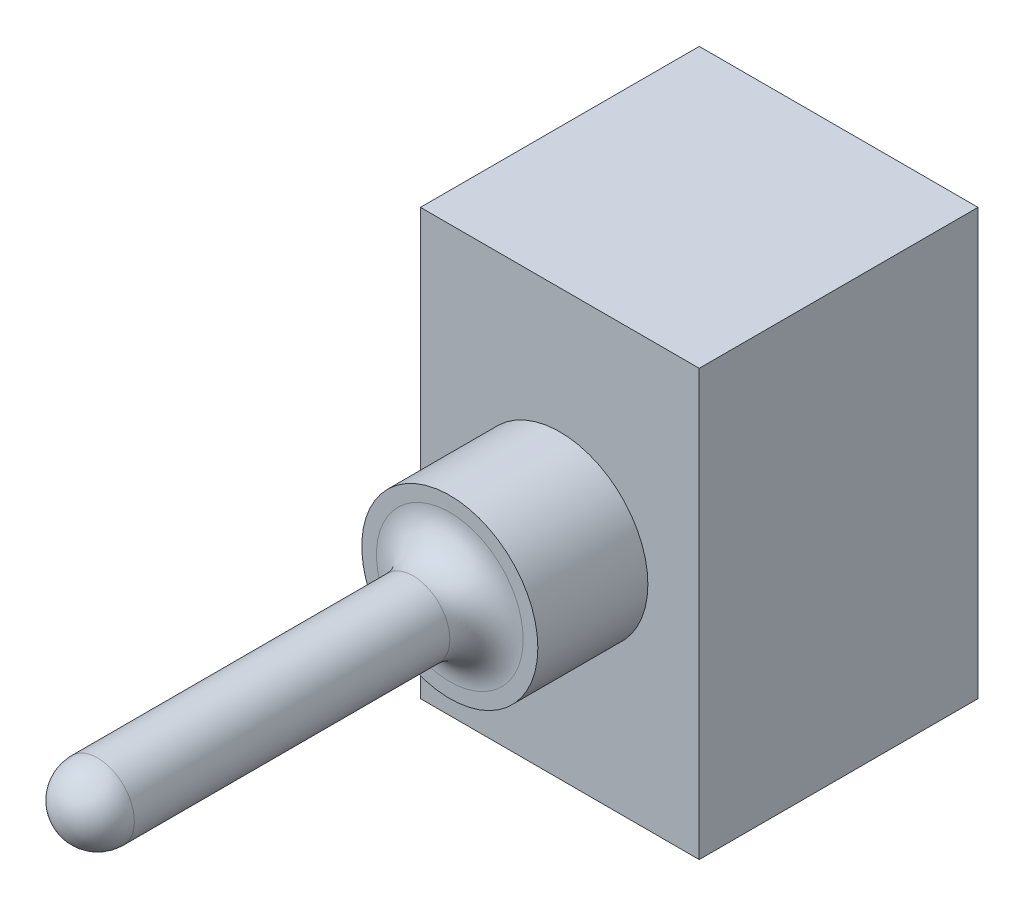
ISO-10303-21;
HEADER;
FILE_DESCRIPTION(('STEP AP214'),'2;1');
FILE_NAME('part.step','',(''),(''),'','','');
FILE_SCHEMA(('AUTOMOTIVE_DESIGN { 1 0 10303 214 1 1 1 1 }'));
ENDSEC;
DATA;
#1=APPLICATION_CONTEXT('core data for automotive mechanical design processes');
#2=APPLICATION_PROTOCOL_DEFINITION('international standard','automotive_design',2000,#1);
#3=PRODUCT_CONTEXT('',#1,'mechanical');
#4=PRODUCT('Part','Part','',(#3));
#5=PRODUCT_RELATED_PRODUCT_CATEGORY('part','',(#4));
#6=PRODUCT_DEFINITION_FORMATION('','',#4);
#7=PRODUCT_DEFINITION_CONTEXT('part definition',#1,'design');
#8=PRODUCT_DEFINITION('design','',#6,#7);
#9=PRODUCT_DEFINITION_SHAPE('','',#8);
#10=(LENGTH_UNIT() NAMED_UNIT(*) SI_UNIT(.MILLI.,.METRE.));
#11=(NAMED_UNIT(*) PLANE_ANGLE_UNIT() SI_UNIT($,.RADIAN.));
#12=(NAMED_UNIT(*) SI_UNIT($,.STERADIAN.) SOLID_ANGLE_UNIT());
#13=UNCERTAINTY_MEASURE_WITH_UNIT(LENGTH_MEASURE(1.E-05),#10,'distance_accuracy_value','');
#14=(GEOMETRIC_REPRESENTATION_CONTEXT(3) GLOBAL_UNCERTAINTY_ASSIGNED_CONTEXT((#13)) GLOBAL_UNIT_ASSIGNED_CONTEXT((#10,
#11,#12)) REPRESENTATION_CONTEXT('',''));
#15=CARTESIAN_POINT('',(0.,0.,0.));
#16=DIRECTION('',(0.,0.,1.));
#17=DIRECTION('',(1.,0.,0.));
#18=AXIS2_PLACEMENT_3D('',#15,#16,#17);
#19=CARTESIAN_POINT('',(-63.8068057080132,29.1818181818182,19.));
#20=DIRECTION('',(1.,0.,0.));
#21=DIRECTION('',(0.,0.,-1.));
#22=AXIS2_PLACEMENT_3D('',#19,#20,#21);
#23=PLANE('',#22);
#24=DIRECTION('',(0.,-1.,0.));
#25=VECTOR('',#24,1.);
#26=CARTESIAN_POINT('',(-63.8068057080132,29.1818181818182,0.));
#27=LINE('',#26,#25);
#28=CARTESIAN_POINT('',(-63.8068057080132,29.1818181818182,0.));
#29=VERTEX_POINT('',#28);
#30=CARTESIAN_POINT('',(-63.8068057080132,0.181818181818182,0.));
#31=VERTEX_POINT('',#30);
#32=EDGE_CURVE('E102',#29,#31,#27,.T.);
#33=ORIENTED_EDGE('',*,*,#32,.T.);
#34=DIRECTION('',(0.,0.,-1.));
#35=VECTOR('',#34,1.);
#36=CARTESIAN_POINT('',(-63.8068057080132,0.181818181818182,19.));
#37=LINE('',#36,#35);
#38=CARTESIAN_POINT('',(-63.8068057080132,0.181818181818182,19.));
#39=VERTEX_POINT('',#38);
#40=EDGE_CURVE('E93',#39,#31,#37,.T.);
#41=ORIENTED_EDGE('',*,*,#40,.F.);
#42=DIRECTION('',(0.,-1.,0.));
#43=VECTOR('',#42,1.);
#44=CARTESIAN_POINT('',(-63.8068057080132,29.1818181818182,19.));
#45=LINE('',#44,#43);
#46=CARTESIAN_POINT('',(-63.8068057080132,29.1818181818182,19.));
#47=VERTEX_POINT('',#46);
#48=EDGE_CURVE('E87',#47,#39,#45,.T.);
#49=ORIENTED_EDGE('',*,*,#48,.F.);
#50=DIRECTION('',(0.,0.,-1.));
#51=VECTOR('',#50,1.);
#52=CARTESIAN_POINT('',(-63.8068057080132,29.1818181818182,19.));
#53=LINE('',#52,#51);
#54=EDGE_CURVE('E98',#47,#29,#53,.T.);
#55=ORIENTED_EDGE('',*,*,#54,.T.);
#56=EDGE_LOOP('',(#33,#41,#49,#55));
#57=FACE_BOUND('',#56,.T.);
#58=ADVANCED_FACE('F34',(#57),#23,.F.);
#59=CARTESIAN_POINT('',(-63.8068057080132,0.181818181818182,19.));
#60=DIRECTION('',(0.,1.,0.));
#61=DIRECTION('',(0.,0.,1.));
#62=AXIS2_PLACEMENT_3D('',#59,#60,#61);
#63=PLANE('',#62);
#64=DIRECTION('',(1.,0.,0.));
#65=VECTOR('',#64,1.);
#66=CARTESIAN_POINT('',(-63.8068057080132,0.181818181818182,0.));
#67=LINE('',#66,#65);
#68=CARTESIAN_POINT('',(-44.8068057080132,0.181818181818182,0.));
#69=VERTEX_POINT('',#68);
#70=EDGE_CURVE('E92',#31,#69,#67,.T.);
#71=ORIENTED_EDGE('',*,*,#70,.T.);
#72=DIRECTION('',(0.,0.,-1.));
#73=VECTOR('',#72,1.);
#74=CARTESIAN_POINT('',(-44.8068057080132,0.181818181818182,19.));
#75=LINE('',#74,#73);
#76=CARTESIAN_POINT('',(-44.8068057080132,0.181818181818182,19.));
#77=VERTEX_POINT('',#76);
#78=EDGE_CURVE('E90',#77,#69,#75,.T.);
#79=ORIENTED_EDGE('',*,*,#78,.F.);
#80=DIRECTION('',(1.,0.,0.));
#81=VECTOR('',#80,1.);
#82=CARTESIAN_POINT('',(-63.8068057080132,0.181818181818182,19.));
#83=LINE('',#82,#81);
#84=EDGE_CURVE('E82',#39,#77,#83,.T.);
#85=ORIENTED_EDGE('',*,*,#84,.F.);
#86=ORIENTED_EDGE('',*,*,#40,.T.);
#87=EDGE_LOOP('',(#71,#79,#85,#86));
#88=FACE_BOUND('',#87,.T.);
#89=ADVANCED_FACE('F91',(#88),#63,.F.);
#90=CARTESIAN_POINT('',(-44.8068057080132,29.1818181818182,19.));
#91=DIRECTION('',(-1.,0.,0.));
#92=DIRECTION('',(0.,0.,1.));
#93=AXIS2_PLACEMENT_3D('',#90,#91,#92);
#94=PLANE('',#93);
#95=DIRECTION('',(0.,1.,0.));
#96=VECTOR('',#95,1.);
#97=CARTESIAN_POINT('',(-44.8068057080132,29.1818181818182,0.));
#98=LINE('',#97,#96);
#99=CARTESIAN_POINT('',(-44.8068057080132,29.1818181818182,0.));
#100=VERTEX_POINT('',#99);
#101=EDGE_CURVE('E68',#69,#100,#98,.T.);
#102=ORIENTED_EDGE('',*,*,#101,.T.);
#103=DIRECTION('',(0.,0.,-1.));
#104=VECTOR('',#103,1.);
#105=CARTESIAN_POINT('',(-44.8068057080132,29.1818181818182,19.));
#106=LINE('',#105,#104);
#107=CARTESIAN_POINT('',(-44.8068057080132,29.1818181818182,19.));
#108=VERTEX_POINT('',#107);
#109=EDGE_CURVE('E94',#108,#100,#106,.T.);
#110=ORIENTED_EDGE('',*,*,#109,.F.);
#111=DIRECTION('',(0.,1.,0.));
#112=VECTOR('',#111,1.);
#113=CARTESIAN_POINT('',(-44.8068057080132,29.1818181818182,19.));
#114=LINE('',#113,#112);
#115=EDGE_CURVE('E85',#77,#108,#114,.T.);
#116=ORIENTED_EDGE('',*,*,#115,.F.);
#117=ORIENTED_EDGE('',*,*,#78,.T.);
#118=EDGE_LOOP('',(#102,#110,#116,#117));
#119=FACE_BOUND('',#118,.T.);
#120=ADVANCED_FACE('F96',(#119),#94,.F.);
#121=CARTESIAN_POINT('',(-63.8068057080132,29.1818181818182,19.));
#122=DIRECTION('',(0.,-1.,0.));
#123=DIRECTION('',(0.,0.,-1.));
#124=AXIS2_PLACEMENT_3D('',#121,#122,#123);
#125=PLANE('',#124);
#126=DIRECTION('',(-1.,0.,0.));
#127=VECTOR('',#126,1.);
#128=CARTESIAN_POINT('',(-63.8068057080132,29.1818181818182,0.));
#129=LINE('',#128,#127);
#130=EDGE_CURVE('E74',#100,#29,#129,.T.);
#131=ORIENTED_EDGE('',*,*,#130,.T.);
#132=ORIENTED_EDGE('',*,*,#54,.F.);
#133=DIRECTION('',(-1.,0.,0.));
#134=VECTOR('',#133,1.);
#135=CARTESIAN_POINT('',(-63.8068057080132,29.1818181818182,19.));
#136=LINE('',#135,#134);
#137=EDGE_CURVE('E51',#108,#47,#136,.T.);
#138=ORIENTED_EDGE('',*,*,#137,.F.);
#139=ORIENTED_EDGE('',*,*,#109,.T.);
#140=EDGE_LOOP('',(#131,#132,#138,#139));
#141=FACE_BOUND('',#140,.T.);
#142=ADVANCED_FACE('F141',(#141),#125,.F.);
#143=CARTESIAN_POINT('',(0.,0.,19.));
#144=DIRECTION('',(0.,0.,1.));
#145=DIRECTION('',(1.,0.,0.));
#146=AXIS2_PLACEMENT_3D('',#143,#144,#145);
#147=PLANE('',#146);
#148=CARTESIAN_POINT('',(-54.3068057080132,14.6818181818182,19.));
#149=DIRECTION('',(0.,0.,1.));
#150=DIRECTION('',(1.,0.,0.));
#151=AXIS2_PLACEMENT_3D('',#148,#149,#150);
#152=CIRCLE('',#151,6.);
#153=CARTESIAN_POINT('',(-48.3068057080132,14.6818181818182,19.));
#154=VERTEX_POINT('',#153);
#155=EDGE_CURVE('E162',#154,#154,#152,.T.);
#156=ORIENTED_EDGE('',*,*,#155,.F.);
#157=EDGE_LOOP('',(#156));
#158=FACE_BOUND('',#157,.T.);
#159=ORIENTED_EDGE('',*,*,#48,.T.);
#160=ORIENTED_EDGE('',*,*,#84,.T.);
#161=ORIENTED_EDGE('',*,*,#115,.T.);
#162=ORIENTED_EDGE('',*,*,#137,.T.);
#163=EDGE_LOOP('',(#159,#160,#161,#162));
#164=FACE_BOUND('',#163,.T.);
#165=ADVANCED_FACE('F83',(#158,#164),#147,.T.);
#166=CARTESIAN_POINT('',(0.,0.,0.));
#167=DIRECTION('',(0.,0.,1.));
#168=DIRECTION('',(1.,0.,0.));
#169=AXIS2_PLACEMENT_3D('',#166,#167,#168);
#170=PLANE('',#169);
#171=ORIENTED_EDGE('',*,*,#32,.F.);
#172=ORIENTED_EDGE('',*,*,#130,.F.);
#173=ORIENTED_EDGE('',*,*,#101,.F.);
#174=ORIENTED_EDGE('',*,*,#70,.F.);
#175=EDGE_LOOP('',(#171,#172,#173,#174));
#176=FACE_BOUND('',#175,.T.);
#177=ADVANCED_FACE('F144',(#176),#170,.F.);
#178=CARTESIAN_POINT('',(-54.3068057080132,14.6818181818182,26.5));
#179=DIRECTION('',(0.,0.,-1.));
#180=DIRECTION('',(-1.,0.,0.));
#181=AXIS2_PLACEMENT_3D('',#178,#179,#180);
#182=CYLINDRICAL_SURFACE('',#181,6.);
#183=CARTESIAN_POINT('',(-54.3068057080132,14.6818181818182,26.5));
#184=DIRECTION('',(0.,0.,1.));
#185=DIRECTION('',(1.,0.,0.));
#186=AXIS2_PLACEMENT_3D('',#183,#184,#185);
#187=CIRCLE('',#186,6.);
#188=CARTESIAN_POINT('',(-48.3068057080132,14.6818181818182,26.5));
#189=VERTEX_POINT('',#188);
#190=EDGE_CURVE('E105',#189,#189,#187,.T.);
#191=ORIENTED_EDGE('',*,*,#190,.F.);
#192=EDGE_LOOP('',(#191));
#193=FACE_BOUND('',#192,.T.);
#194=ORIENTED_EDGE('',*,*,#155,.T.);
#195=EDGE_LOOP('',(#194));
#196=FACE_BOUND('',#195,.T.);
#197=ADVANCED_FACE('F147',(#193,#196),#182,.T.);
#198=CARTESIAN_POINT('',(-54.3068057080132,14.6818181818182,26.5));
#199=DIRECTION('',(0.,0.,1.));
#200=DIRECTION('',(1.,0.,0.));
#201=AXIS2_PLACEMENT_3D('',#198,#199,#200);
#202=PLANE('',#201);
#203=CARTESIAN_POINT('',(-54.3068057080132,14.6818181818182,26.5));
#204=DIRECTION('',(0.,0.,1.));
#205=DIRECTION('',(1.,0.,0.));
#206=AXIS2_PLACEMENT_3D('',#203,#204,#205);
#207=CIRCLE('',#206,5.);
#208=CARTESIAN_POINT('',(-49.3068057080132,14.6818181818182,26.5));
#209=VERTEX_POINT('',#208);
#210=EDGE_CURVE('E11',#209,#209,#207,.F.);
#211=ORIENTED_EDGE('',*,*,#210,.T.);
#212=EDGE_LOOP('',(#211));
#213=FACE_BOUND('',#212,.T.);
#214=ORIENTED_EDGE('',*,*,#190,.T.);
#215=EDGE_LOOP('',(#214));
#216=FACE_BOUND('',#215,.T.);
#217=ADVANCED_FACE('F128',(#213,#216),#202,.T.);
#218=CARTESIAN_POINT('',(-54.3068057080132,14.6818181818182,53.));
#219=DIRECTION('',(0.,0.,-1.));
#220=DIRECTION('',(-1.,0.,0.));
#221=AXIS2_PLACEMENT_3D('',#218,#219,#220);
#222=CYLINDRICAL_SURFACE('',#221,2.5);
#223=CARTESIAN_POINT('',(-54.3068057080132,14.6818181818182,29.));
#224=DIRECTION('',(0.,0.,1.));
#225=DIRECTION('',(1.,0.,0.));
#226=AXIS2_PLACEMENT_3D('',#223,#224,#225);
#227=CIRCLE('',#226,2.5);
#228=CARTESIAN_POINT('',(-51.8068057080132,14.6818181818182,29.));
#229=VERTEX_POINT('',#228);
#230=EDGE_CURVE('E43',#229,#229,#227,.T.);
#231=ORIENTED_EDGE('',*,*,#230,.T.);
#232=EDGE_LOOP('',(#231));
#233=FACE_BOUND('',#232,.T.);
#234=CARTESIAN_POINT('',(-54.3068057080132,14.6818181818182,50.5));
#235=DIRECTION('',(0.,0.,-1.));
#236=DIRECTION('',(-1.,0.,0.));
#237=AXIS2_PLACEMENT_3D('',#234,#235,#236);
#238=CIRCLE('',#237,2.5);
#239=CARTESIAN_POINT('',(-56.8068057080132,14.6818181818182,50.5));
#240=VERTEX_POINT('',#239);
#241=EDGE_CURVE('E112',#240,#240,#238,.T.);
#242=ORIENTED_EDGE('',*,*,#241,.T.);
#243=EDGE_LOOP('',(#242));
#244=FACE_BOUND('',#243,.T.);
#245=ADVANCED_FACE('F117',(#233,#244),#222,.T.);
#246=CARTESIAN_POINT('',(-54.3068057080132,14.6818181818182,29.));
#247=DIRECTION('',(0.,0.,1.));
#248=DIRECTION('',(1.,0.,0.));
#249=AXIS2_PLACEMENT_3D('',#246,#247,#248);
#250=TOROIDAL_SURFACE('',#249,5.,2.5);
#251=ORIENTED_EDGE('',*,*,#210,.F.);
#252=EDGE_LOOP('',(#251));
#253=FACE_BOUND('',#252,.T.);
#254=ORIENTED_EDGE('',*,*,#230,.F.);
#255=EDGE_LOOP('',(#254));
#256=FACE_BOUND('',#255,.T.);
#257=ADVANCED_FACE('F120',(#253,#256),#250,.F.);
#258=CARTESIAN_POINT('',(-54.3068057080132,14.6818181818182,50.5));
#259=DIRECTION('',(0.,0.,1.));
#260=DIRECTION('',(1.,0.,0.));
#261=AXIS2_PLACEMENT_3D('',#258,#259,#260);
#262=SPHERICAL_SURFACE('',#261,2.5);
#263=ORIENTED_EDGE('',*,*,#241,.F.);
#264=EDGE_LOOP('',(#263));
#265=FACE_BOUND('',#264,.T.);
#266=ADVANCED_FACE('F36',(#265),#262,.T.);
#267=CLOSED_SHELL('',(#58,#89,#120,#142,#165,#177,#197,#217,#245,#257,#266));
#268=MANIFOLD_SOLID_BREP('B2',#267);
#269=ADVANCED_BREP_SHAPE_REPRESENTATION('',(#18,#268),#14);
#270=SHAPE_DEFINITION_REPRESENTATION(#9,#269);
ENDSEC;
END-ISO-10303-21;
